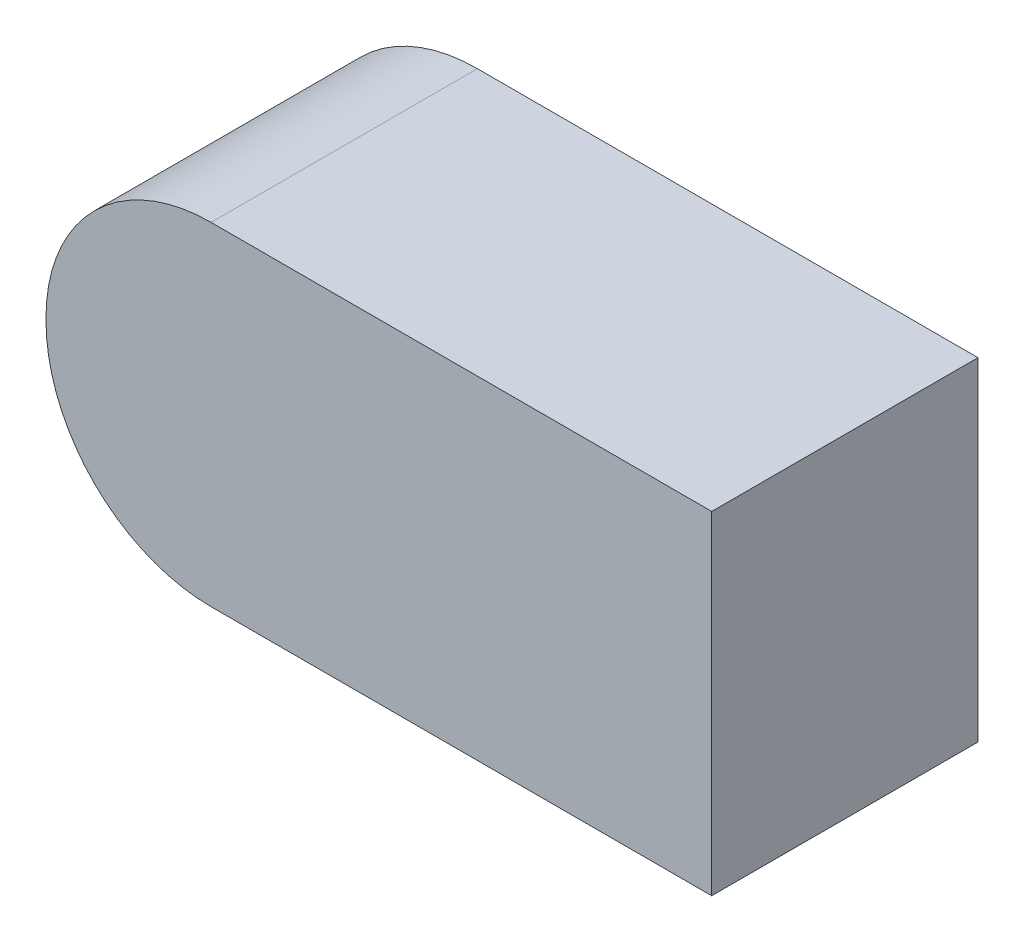
ISO-10303-21;
HEADER;
FILE_DESCRIPTION(('STEP AP214'),'2;1');
FILE_NAME('part.step','',(''),(''),'','','');
FILE_SCHEMA(('AUTOMOTIVE_DESIGN { 1 0 10303 214 1 1 1 1 }'));
ENDSEC;
DATA;
#1=APPLICATION_CONTEXT('core data for automotive mechanical design processes');
#2=APPLICATION_PROTOCOL_DEFINITION('international standard','automotive_design',2000,#1);
#3=PRODUCT_CONTEXT('',#1,'mechanical');
#4=PRODUCT('Part','Part','',(#3));
#5=PRODUCT_RELATED_PRODUCT_CATEGORY('part','',(#4));
#6=PRODUCT_DEFINITION_FORMATION('','',#4);
#7=PRODUCT_DEFINITION_CONTEXT('part definition',#1,'design');
#8=PRODUCT_DEFINITION('design','',#6,#7);
#9=PRODUCT_DEFINITION_SHAPE('','',#8);
#10=(LENGTH_UNIT() NAMED_UNIT(*) SI_UNIT(.MILLI.,.METRE.));
#11=(NAMED_UNIT(*) PLANE_ANGLE_UNIT() SI_UNIT($,.RADIAN.));
#12=(NAMED_UNIT(*) SI_UNIT($,.STERADIAN.) SOLID_ANGLE_UNIT());
#13=UNCERTAINTY_MEASURE_WITH_UNIT(LENGTH_MEASURE(1.E-05),#10,'distance_accuracy_value','');
#14=(GEOMETRIC_REPRESENTATION_CONTEXT(3) GLOBAL_UNCERTAINTY_ASSIGNED_CONTEXT((#13)) GLOBAL_UNIT_ASSIGNED_CONTEXT((#10,
#11,#12)) REPRESENTATION_CONTEXT('',''));
#15=CARTESIAN_POINT('',(0.,0.,0.));
#16=DIRECTION('',(0.,0.,1.));
#17=DIRECTION('',(1.,0.,0.));
#18=AXIS2_PLACEMENT_3D('',#15,#16,#17);
#19=CARTESIAN_POINT('',(-0.126,-0.0009999999999999,0.));
#20=DIRECTION('',(0.,0.,1.));
#21=DIRECTION('',(1.,0.,0.));
#22=AXIS2_PLACEMENT_3D('',#19,#20,#21);
#23=PLANE('',#22);
#24=DIRECTION('',(0.,1.,0.));
#25=VECTOR('',#24,1.);
#26=CARTESIAN_POINT('',(0.25,0.125,0.));
#27=LINE('',#26,#25);
#28=CARTESIAN_POINT('',(0.25,-0.125,0.));
#29=VERTEX_POINT('',#28);
#30=CARTESIAN_POINT('',(0.25,0.125,0.));
#31=VERTEX_POINT('',#30);
#32=EDGE_CURVE('E131',#29,#31,#27,.T.);
#33=ORIENTED_EDGE('',*,*,#32,.F.);
#34=DIRECTION('',(1.,0.,0.));
#35=VECTOR('',#34,1.);
#36=CARTESIAN_POINT('',(-0.126,-0.125,0.));
#37=LINE('',#36,#35);
#38=CARTESIAN_POINT('',(-0.126,-0.125,0.));
#39=VERTEX_POINT('',#38);
#40=EDGE_CURVE('E25',#39,#29,#37,.T.);
#41=ORIENTED_EDGE('',*,*,#40,.F.);
#42=CARTESIAN_POINT('',(-0.126,-0.0009999999999999,0.));
#43=DIRECTION('',(0.,0.,1.));
#44=DIRECTION('',(1.,0.,0.));
#45=AXIS2_PLACEMENT_3D('',#42,#43,#44);
#46=CIRCLE('',#45,0.124);
#47=CARTESIAN_POINT('',(-0.25,-0.0009999999999991,0.));
#48=VERTEX_POINT('',#47);
#49=EDGE_CURVE('E83',#48,#39,#46,.T.);
#50=ORIENTED_EDGE('',*,*,#49,.F.);
#51=DIRECTION('',(0.,-1.,0.));
#52=VECTOR('',#51,1.);
#53=CARTESIAN_POINT('',(-0.25,0.0009999999999991,0.));
#54=LINE('',#53,#52);
#55=CARTESIAN_POINT('',(-0.25,0.0009999999999991,0.));
#56=VERTEX_POINT('',#55);
#57=EDGE_CURVE('E86',#56,#48,#54,.T.);
#58=ORIENTED_EDGE('',*,*,#57,.F.);
#59=CARTESIAN_POINT('',(-0.126,0.001,0.));
#60=DIRECTION('',(0.,0.,1.));
#61=DIRECTION('',(1.,0.,0.));
#62=AXIS2_PLACEMENT_3D('',#59,#60,#61);
#63=CIRCLE('',#62,0.124);
#64=CARTESIAN_POINT('',(-0.126,0.125,0.));
#65=VERTEX_POINT('',#64);
#66=EDGE_CURVE('E147',#65,#56,#63,.T.);
#67=ORIENTED_EDGE('',*,*,#66,.F.);
#68=DIRECTION('',(-1.,0.,0.));
#69=VECTOR('',#68,1.);
#70=CARTESIAN_POINT('',(-0.126,0.125,0.));
#71=LINE('',#70,#69);
#72=EDGE_CURVE('E135',#31,#65,#71,.T.);
#73=ORIENTED_EDGE('',*,*,#72,.F.);
#74=EDGE_LOOP('',(#33,#41,#50,#58,#67,#73));
#75=FACE_BOUND('',#74,.T.);
#76=ADVANCED_FACE('F17',(#75),#23,.F.);
#77=CARTESIAN_POINT('',(-0.126,-0.0009999999999999,0.2));
#78=DIRECTION('',(0.,0.,1.));
#79=DIRECTION('',(1.,0.,0.));
#80=AXIS2_PLACEMENT_3D('',#77,#78,#79);
#81=PLANE('',#80);
#82=DIRECTION('',(0.,1.,0.));
#83=VECTOR('',#82,1.);
#84=CARTESIAN_POINT('',(0.25,0.125,0.2));
#85=LINE('',#84,#83);
#86=CARTESIAN_POINT('',(0.25,-0.125,0.2));
#87=VERTEX_POINT('',#86);
#88=CARTESIAN_POINT('',(0.25,0.125,0.2));
#89=VERTEX_POINT('',#88);
#90=EDGE_CURVE('E133',#87,#89,#85,.T.);
#91=ORIENTED_EDGE('',*,*,#90,.T.);
#92=DIRECTION('',(-1.,0.,0.));
#93=VECTOR('',#92,1.);
#94=CARTESIAN_POINT('',(-0.126,0.125,0.2));
#95=LINE('',#94,#93);
#96=CARTESIAN_POINT('',(-0.126,0.125,0.2));
#97=VERTEX_POINT('',#96);
#98=EDGE_CURVE('E117',#89,#97,#95,.T.);
#99=ORIENTED_EDGE('',*,*,#98,.T.);
#100=CARTESIAN_POINT('',(-0.126,0.001,0.2));
#101=DIRECTION('',(0.,0.,1.));
#102=DIRECTION('',(1.,0.,0.));
#103=AXIS2_PLACEMENT_3D('',#100,#101,#102);
#104=CIRCLE('',#103,0.124);
#105=CARTESIAN_POINT('',(-0.25,0.0009999999999991,0.2));
#106=VERTEX_POINT('',#105);
#107=EDGE_CURVE('E107',#97,#106,#104,.T.);
#108=ORIENTED_EDGE('',*,*,#107,.T.);
#109=DIRECTION('',(0.,-1.,0.));
#110=VECTOR('',#109,1.);
#111=CARTESIAN_POINT('',(-0.25,0.0009999999999991,0.2));
#112=LINE('',#111,#110);
#113=CARTESIAN_POINT('',(-0.25,-0.0009999999999991,0.2));
#114=VERTEX_POINT('',#113);
#115=EDGE_CURVE('E92',#106,#114,#112,.T.);
#116=ORIENTED_EDGE('',*,*,#115,.T.);
#117=CARTESIAN_POINT('',(-0.126,-0.0009999999999999,0.2));
#118=DIRECTION('',(0.,0.,1.));
#119=DIRECTION('',(1.,0.,0.));
#120=AXIS2_PLACEMENT_3D('',#117,#118,#119);
#121=CIRCLE('',#120,0.124);
#122=CARTESIAN_POINT('',(-0.126,-0.125,0.2));
#123=VERTEX_POINT('',#122);
#124=EDGE_CURVE('E97',#114,#123,#121,.T.);
#125=ORIENTED_EDGE('',*,*,#124,.T.);
#126=DIRECTION('',(1.,0.,0.));
#127=VECTOR('',#126,1.);
#128=CARTESIAN_POINT('',(-0.126,-0.125,0.2));
#129=LINE('',#128,#127);
#130=EDGE_CURVE('E11',#123,#87,#129,.T.);
#131=ORIENTED_EDGE('',*,*,#130,.T.);
#132=EDGE_LOOP('',(#91,#99,#108,#116,#125,#131));
#133=FACE_BOUND('',#132,.T.);
#134=ADVANCED_FACE('F167',(#133),#81,.T.);
#135=CARTESIAN_POINT('',(-0.126,-0.125,0.2));
#136=DIRECTION('',(0.,1.,0.));
#137=DIRECTION('',(1.,0.,0.));
#138=AXIS2_PLACEMENT_3D('',#135,#136,#137);
#139=PLANE('',#138);
#140=ORIENTED_EDGE('',*,*,#40,.T.);
#141=DIRECTION('',(0.,0.,-1.));
#142=VECTOR('',#141,1.);
#143=CARTESIAN_POINT('',(0.25,-0.125,0.2));
#144=LINE('',#143,#142);
#145=EDGE_CURVE('E125',#87,#29,#144,.T.);
#146=ORIENTED_EDGE('',*,*,#145,.F.);
#147=ORIENTED_EDGE('',*,*,#130,.F.);
#148=DIRECTION('',(0.,0.,-1.));
#149=VECTOR('',#148,1.);
#150=CARTESIAN_POINT('',(-0.126,-0.125,0.2));
#151=LINE('',#150,#149);
#152=EDGE_CURVE('E91',#123,#39,#151,.T.);
#153=ORIENTED_EDGE('',*,*,#152,.T.);
#154=EDGE_LOOP('',(#140,#146,#147,#153));
#155=FACE_BOUND('',#154,.T.);
#156=ADVANCED_FACE('F124',(#155),#139,.F.);
#157=CARTESIAN_POINT('',(-0.126,-0.0009999999999999,0.2));
#158=DIRECTION('',(0.,0.,-1.));
#159=DIRECTION('',(-1.,0.,0.));
#160=AXIS2_PLACEMENT_3D('',#157,#158,#159);
#161=CYLINDRICAL_SURFACE('',#160,0.124);
#162=ORIENTED_EDGE('',*,*,#49,.T.);
#163=ORIENTED_EDGE('',*,*,#152,.F.);
#164=ORIENTED_EDGE('',*,*,#124,.F.);
#165=DIRECTION('',(0.,0.,-1.));
#166=VECTOR('',#165,1.);
#167=CARTESIAN_POINT('',(-0.25,-0.0009999999999991,0.2));
#168=LINE('',#167,#166);
#169=EDGE_CURVE('E95',#114,#48,#168,.T.);
#170=ORIENTED_EDGE('',*,*,#169,.T.);
#171=EDGE_LOOP('',(#162,#163,#164,#170));
#172=FACE_BOUND('',#171,.T.);
#173=ADVANCED_FACE('F96',(#172),#161,.T.);
#174=CARTESIAN_POINT('',(-0.25,0.0009999999999991,0.2));
#175=DIRECTION('',(1.,0.,0.));
#176=DIRECTION('',(0.,1.,0.));
#177=AXIS2_PLACEMENT_3D('',#174,#175,#176);
#178=PLANE('',#177);
#179=ORIENTED_EDGE('',*,*,#57,.T.);
#180=ORIENTED_EDGE('',*,*,#169,.F.);
#181=ORIENTED_EDGE('',*,*,#115,.F.);
#182=DIRECTION('',(0.,0.,-1.));
#183=VECTOR('',#182,1.);
#184=CARTESIAN_POINT('',(-0.25,0.0009999999999991,0.2));
#185=LINE('',#184,#183);
#186=EDGE_CURVE('E104',#106,#56,#185,.T.);
#187=ORIENTED_EDGE('',*,*,#186,.T.);
#188=EDGE_LOOP('',(#179,#180,#181,#187));
#189=FACE_BOUND('',#188,.T.);
#190=ADVANCED_FACE('F102',(#189),#178,.F.);
#191=CARTESIAN_POINT('',(-0.126,0.001,0.2));
#192=DIRECTION('',(0.,0.,-1.));
#193=DIRECTION('',(-1.,0.,0.));
#194=AXIS2_PLACEMENT_3D('',#191,#192,#193);
#195=CYLINDRICAL_SURFACE('',#194,0.124);
#196=ORIENTED_EDGE('',*,*,#66,.T.);
#197=ORIENTED_EDGE('',*,*,#186,.F.);
#198=ORIENTED_EDGE('',*,*,#107,.F.);
#199=DIRECTION('',(0.,0.,-1.));
#200=VECTOR('',#199,1.);
#201=CARTESIAN_POINT('',(-0.126,0.125,0.2));
#202=LINE('',#201,#200);
#203=EDGE_CURVE('E153',#97,#65,#202,.T.);
#204=ORIENTED_EDGE('',*,*,#203,.T.);
#205=EDGE_LOOP('',(#196,#197,#198,#204));
#206=FACE_BOUND('',#205,.T.);
#207=ADVANCED_FACE('F166',(#206),#195,.T.);
#208=CARTESIAN_POINT('',(-0.126,0.125,0.2));
#209=DIRECTION('',(0.,-1.,0.));
#210=DIRECTION('',(0.,0.,-1.));
#211=AXIS2_PLACEMENT_3D('',#208,#209,#210);
#212=PLANE('',#211);
#213=ORIENTED_EDGE('',*,*,#72,.T.);
#214=ORIENTED_EDGE('',*,*,#203,.F.);
#215=ORIENTED_EDGE('',*,*,#98,.F.);
#216=DIRECTION('',(0.,0.,-1.));
#217=VECTOR('',#216,1.);
#218=CARTESIAN_POINT('',(0.25,0.125,0.2));
#219=LINE('',#218,#217);
#220=EDGE_CURVE('E140',#89,#31,#219,.T.);
#221=ORIENTED_EDGE('',*,*,#220,.T.);
#222=EDGE_LOOP('',(#213,#214,#215,#221));
#223=FACE_BOUND('',#222,.T.);
#224=ADVANCED_FACE('F169',(#223),#212,.F.);
#225=CARTESIAN_POINT('',(0.25,0.125,0.2));
#226=DIRECTION('',(-1.,0.,0.));
#227=DIRECTION('',(0.,1.,0.));
#228=AXIS2_PLACEMENT_3D('',#225,#226,#227);
#229=PLANE('',#228);
#230=ORIENTED_EDGE('',*,*,#32,.T.);
#231=ORIENTED_EDGE('',*,*,#220,.F.);
#232=ORIENTED_EDGE('',*,*,#90,.F.);
#233=ORIENTED_EDGE('',*,*,#145,.T.);
#234=EDGE_LOOP('',(#230,#231,#232,#233));
#235=FACE_BOUND('',#234,.T.);
#236=ADVANCED_FACE('F129',(#235),#229,.F.);
#237=CLOSED_SHELL('',(#76,#134,#156,#173,#190,#207,#224,#236));
#238=MANIFOLD_SOLID_BREP('B1',#237);
#239=ADVANCED_BREP_SHAPE_REPRESENTATION('',(#18,#238),#14);
#240=SHAPE_DEFINITION_REPRESENTATION(#9,#239);
ENDSEC;
END-ISO-10303-21;
